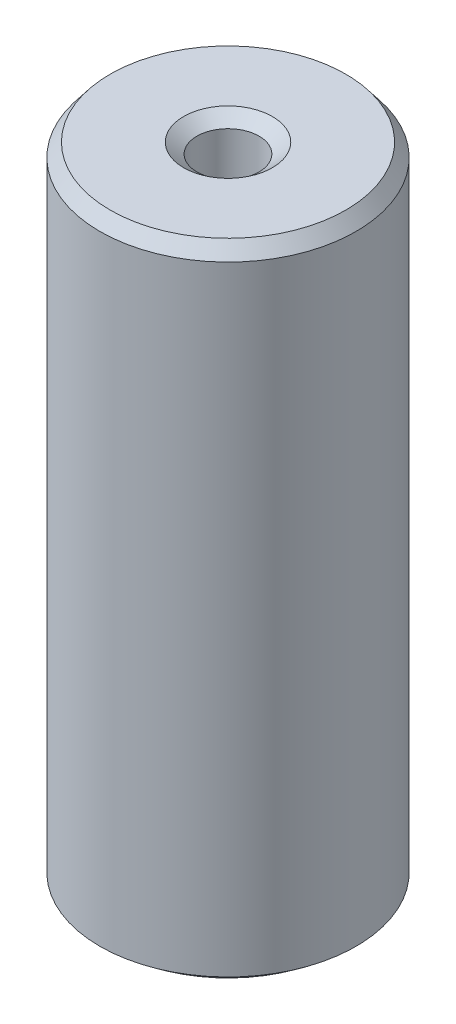
ISO-10303-21;
HEADER;
FILE_DESCRIPTION(('STEP AP214'),'2;1');
FILE_NAME('part.step','',(''),(''),'','','');
FILE_SCHEMA(('AUTOMOTIVE_DESIGN { 1 0 10303 214 1 1 1 1 }'));
ENDSEC;
DATA;
#1=APPLICATION_CONTEXT('core data for automotive mechanical design processes');
#2=APPLICATION_PROTOCOL_DEFINITION('international standard','automotive_design',2000,#1);
#3=PRODUCT_CONTEXT('',#1,'mechanical');
#4=PRODUCT('Part','Part','',(#3));
#5=PRODUCT_RELATED_PRODUCT_CATEGORY('part','',(#4));
#6=PRODUCT_DEFINITION_FORMATION('','',#4);
#7=PRODUCT_DEFINITION_CONTEXT('part definition',#1,'design');
#8=PRODUCT_DEFINITION('design','',#6,#7);
#9=PRODUCT_DEFINITION_SHAPE('','',#8);
#10=(LENGTH_UNIT() NAMED_UNIT(*) SI_UNIT(.MILLI.,.METRE.));
#11=(NAMED_UNIT(*) PLANE_ANGLE_UNIT() SI_UNIT($,.RADIAN.));
#12=(NAMED_UNIT(*) SI_UNIT($,.STERADIAN.) SOLID_ANGLE_UNIT());
#13=UNCERTAINTY_MEASURE_WITH_UNIT(LENGTH_MEASURE(1.E-05),#10,'distance_accuracy_value','');
#14=(GEOMETRIC_REPRESENTATION_CONTEXT(3) GLOBAL_UNCERTAINTY_ASSIGNED_CONTEXT((#13)) GLOBAL_UNIT_ASSIGNED_CONTEXT((#10,
#11,#12)) REPRESENTATION_CONTEXT('',''));
#15=CARTESIAN_POINT('',(0.,0.,0.));
#16=DIRECTION('',(0.,0.,1.));
#17=DIRECTION('',(1.,0.,0.));
#18=AXIS2_PLACEMENT_3D('',#15,#16,#17);
#19=CARTESIAN_POINT('',(0.,25.0852918289628,0.));
#20=DIRECTION('',(0.,-1.,0.));
#21=DIRECTION('',(0.,0.,-1.));
#22=AXIS2_PLACEMENT_3D('',#19,#20,#21);
#23=CYLINDRICAL_SURFACE('',#22,5.);
#24=CARTESIAN_POINT('',(0.,0.402586487901573,0.));
#25=DIRECTION('',(0.,1.,0.));
#26=DIRECTION('',(0.,0.,1.));
#27=AXIS2_PLACEMENT_3D('',#24,#25,#26);
#28=CIRCLE('',#27,5.);
#29=CARTESIAN_POINT('',(0.,0.402586487901573,5.));
#30=VERTEX_POINT('',#29);
#31=EDGE_CURVE('E10',#30,#30,#28,.T.);
#32=ORIENTED_EDGE('',*,*,#31,.T.);
#33=EDGE_LOOP('',(#32));
#34=FACE_BOUND('',#33,.T.);
#35=CARTESIAN_POINT('',(0.,24.5650451506011,0.));
#36=DIRECTION('',(0.,1.,0.));
#37=DIRECTION('',(0.,0.,1.));
#38=AXIS2_PLACEMENT_3D('',#35,#36,#37);
#39=CIRCLE('',#38,5.);
#40=CARTESIAN_POINT('',(0.,24.5650451506011,5.));
#41=VERTEX_POINT('',#40);
#42=EDGE_CURVE('E50',#41,#41,#39,.F.);
#43=ORIENTED_EDGE('',*,*,#42,.T.);
#44=EDGE_LOOP('',(#43));
#45=FACE_BOUND('',#44,.T.);
#46=ADVANCED_FACE('F39',(#34,#45),#23,.T.);
#47=CARTESIAN_POINT('',(0.,25.0852918289628,0.));
#48=DIRECTION('',(0.,1.,0.));
#49=DIRECTION('',(0.,0.,1.));
#50=AXIS2_PLACEMENT_3D('',#47,#48,#49);
#51=PLANE('',#50);
#52=CARTESIAN_POINT('',(0.,25.0852918289628,0.));
#53=DIRECTION('',(0.,1.,0.));
#54=DIRECTION('',(0.,0.,1.));
#55=AXIS2_PLACEMENT_3D('',#52,#53,#54);
#56=CIRCLE('',#55,1.73221840892958);
#57=CARTESIAN_POINT('',(0.,25.0852918289628,1.73221840892958));
#58=VERTEX_POINT('',#57);
#59=EDGE_CURVE('E58',#58,#58,#56,.F.);
#60=ORIENTED_EDGE('',*,*,#59,.T.);
#61=EDGE_LOOP('',(#60));
#62=FACE_BOUND('',#61,.T.);
#63=CARTESIAN_POINT('',(0.,25.0852918289628,0.));
#64=DIRECTION('',(0.,1.,0.));
#65=DIRECTION('',(0.,0.,1.));
#66=AXIS2_PLACEMENT_3D('',#63,#64,#65);
#67=CIRCLE('',#66,4.59741351209843);
#68=CARTESIAN_POINT('',(0.,25.0852918289628,4.59741351209843));
#69=VERTEX_POINT('',#68);
#70=EDGE_CURVE('E61',#69,#69,#67,.T.);
#71=ORIENTED_EDGE('',*,*,#70,.T.);
#72=EDGE_LOOP('',(#71));
#73=FACE_BOUND('',#72,.T.);
#74=ADVANCED_FACE('F88',(#62,#73),#51,.T.);
#75=CARTESIAN_POINT('',(0.,0.,0.));
#76=DIRECTION('',(0.,1.,0.));
#77=DIRECTION('',(0.,0.,1.));
#78=AXIS2_PLACEMENT_3D('',#75,#76,#77);
#79=PLANE('',#78);
#80=CARTESIAN_POINT('',(0.,0.,0.));
#81=DIRECTION('',(0.,1.,0.));
#82=DIRECTION('',(0.,0.,1.));
#83=AXIS2_PLACEMENT_3D('',#80,#81,#82);
#84=CIRCLE('',#83,1.61455821846945);
#85=CARTESIAN_POINT('',(0.,0.,1.61455821846945));
#86=VERTEX_POINT('',#85);
#87=EDGE_CURVE('E51',#86,#86,#84,.T.);
#88=ORIENTED_EDGE('',*,*,#87,.T.);
#89=EDGE_LOOP('',(#88));
#90=FACE_BOUND('',#89,.T.);
#91=CARTESIAN_POINT('',(0.,0.,0.));
#92=DIRECTION('',(0.,1.,0.));
#93=DIRECTION('',(0.,0.,1.));
#94=AXIS2_PLACEMENT_3D('',#91,#92,#93);
#95=CIRCLE('',#94,4.47975332163829);
#96=CARTESIAN_POINT('',(0.,0.,4.47975332163829));
#97=VERTEX_POINT('',#96);
#98=EDGE_CURVE('E54',#97,#97,#95,.F.);
#99=ORIENTED_EDGE('',*,*,#98,.T.);
#100=EDGE_LOOP('',(#99));
#101=FACE_BOUND('',#100,.T.);
#102=ADVANCED_FACE('F83',(#90,#101),#79,.F.);
#103=CARTESIAN_POINT('',(0.,25.0852918289628,0.));
#104=DIRECTION('',(0.,-1.,0.));
#105=DIRECTION('',(0.,0.,-1.));
#106=AXIS2_PLACEMENT_3D('',#103,#104,#105);
#107=CYLINDRICAL_SURFACE('',#106,1.21197173056787);
#108=CARTESIAN_POINT('',(0.,24.6827053410612,0.));
#109=DIRECTION('',(0.,1.,0.));
#110=DIRECTION('',(0.,0.,1.));
#111=AXIS2_PLACEMENT_3D('',#108,#109,#110);
#112=CIRCLE('',#111,1.21197173056787);
#113=CARTESIAN_POINT('',(0.,24.6827053410612,1.21197173056787));
#114=VERTEX_POINT('',#113);
#115=EDGE_CURVE('E67',#114,#114,#112,.T.);
#116=ORIENTED_EDGE('',*,*,#115,.T.);
#117=EDGE_LOOP('',(#116));
#118=FACE_BOUND('',#117,.T.);
#119=CARTESIAN_POINT('',(0.,0.520246678361709,0.));
#120=DIRECTION('',(0.,1.,0.));
#121=DIRECTION('',(0.,0.,1.));
#122=AXIS2_PLACEMENT_3D('',#119,#120,#121);
#123=CIRCLE('',#122,1.21197173056787);
#124=CARTESIAN_POINT('',(0.,0.520246678361709,1.21197173056787));
#125=VERTEX_POINT('',#124);
#126=EDGE_CURVE('E69',#125,#125,#123,.F.);
#127=ORIENTED_EDGE('',*,*,#126,.T.);
#128=EDGE_LOOP('',(#127));
#129=FACE_BOUND('',#128,.T.);
#130=ADVANCED_FACE('F71',(#118,#129),#107,.F.);
#131=CARTESIAN_POINT('',(0.,24.6827053410612,0.));
#132=DIRECTION('',(0.,1.,0.));
#133=DIRECTION('',(0.,0.,1.));
#134=AXIS2_PLACEMENT_3D('',#131,#132,#133);
#135=CONICAL_SURFACE('',#134,1.21197173056787,0.912212827216326);
#136=ORIENTED_EDGE('',*,*,#59,.F.);
#137=EDGE_LOOP('',(#136));
#138=FACE_BOUND('',#137,.T.);
#139=ORIENTED_EDGE('',*,*,#115,.F.);
#140=EDGE_LOOP('',(#139));
#141=FACE_BOUND('',#140,.T.);
#142=ADVANCED_FACE('F77',(#138,#141),#135,.F.);
#143=CARTESIAN_POINT('',(0.,0.,0.));
#144=DIRECTION('',(0.,-1.,0.));
#145=DIRECTION('',(0.,0.,-1.));
#146=AXIS2_PLACEMENT_3D('',#143,#144,#145);
#147=CONICAL_SURFACE('',#146,1.61455821846945,0.658583499578575);
#148=ORIENTED_EDGE('',*,*,#126,.F.);
#149=EDGE_LOOP('',(#148));
#150=FACE_BOUND('',#149,.T.);
#151=ORIENTED_EDGE('',*,*,#87,.F.);
#152=EDGE_LOOP('',(#151));
#153=FACE_BOUND('',#152,.T.);
#154=ADVANCED_FACE('F73',(#150,#153),#147,.F.);
#155=CARTESIAN_POINT('',(0.,0.402586487901573,0.));
#156=DIRECTION('',(0.,1.,0.));
#157=DIRECTION('',(0.,0.,1.));
#158=AXIS2_PLACEMENT_3D('',#155,#156,#157);
#159=CONICAL_SURFACE('',#158,5.,0.912212827216323);
#160=ORIENTED_EDGE('',*,*,#98,.F.);
#161=EDGE_LOOP('',(#160));
#162=FACE_BOUND('',#161,.T.);
#163=ORIENTED_EDGE('',*,*,#31,.F.);
#164=EDGE_LOOP('',(#163));
#165=FACE_BOUND('',#164,.T.);
#166=ADVANCED_FACE('F76',(#162,#165),#159,.T.);
#167=CARTESIAN_POINT('',(0.,25.0852918289628,0.));
#168=DIRECTION('',(0.,-1.,0.));
#169=DIRECTION('',(0.,0.,-1.));
#170=AXIS2_PLACEMENT_3D('',#167,#168,#169);
#171=CONICAL_SURFACE('',#170,4.59741351209843,0.658583499578571);
#172=ORIENTED_EDGE('',*,*,#42,.F.);
#173=EDGE_LOOP('',(#172));
#174=FACE_BOUND('',#173,.T.);
#175=ORIENTED_EDGE('',*,*,#70,.F.);
#176=EDGE_LOOP('',(#175));
#177=FACE_BOUND('',#176,.T.);
#178=ADVANCED_FACE('F45',(#174,#177),#171,.T.);
#179=CLOSED_SHELL('',(#46,#74,#102,#130,#142,#154,#166,#178));
#180=MANIFOLD_SOLID_BREP('B2',#179);
#181=ADVANCED_BREP_SHAPE_REPRESENTATION('',(#18,#180),#14);
#182=SHAPE_DEFINITION_REPRESENTATION(#9,#181);
ENDSEC;
END-ISO-10303-21;
